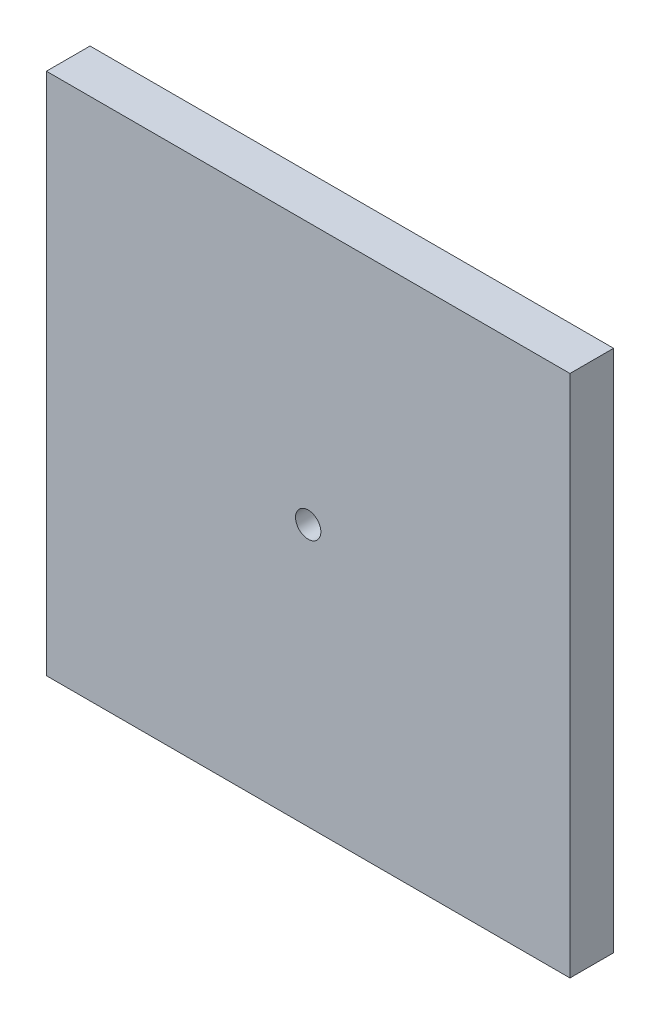
ISO-10303-21;
HEADER;
FILE_DESCRIPTION(('STEP AP214'),'2;1');
FILE_NAME('part.step','',(''),(''),'','','');
FILE_SCHEMA(('AUTOMOTIVE_DESIGN { 1 0 10303 214 1 1 1 1 }'));
ENDSEC;
DATA;
#1=APPLICATION_CONTEXT('core data for automotive mechanical design processes');
#2=APPLICATION_PROTOCOL_DEFINITION('international standard','automotive_design',2000,#1);
#3=PRODUCT_CONTEXT('',#1,'mechanical');
#4=PRODUCT('Part','Part','',(#3));
#5=PRODUCT_RELATED_PRODUCT_CATEGORY('part','',(#4));
#6=PRODUCT_DEFINITION_FORMATION('','',#4);
#7=PRODUCT_DEFINITION_CONTEXT('part definition',#1,'design');
#8=PRODUCT_DEFINITION('design','',#6,#7);
#9=PRODUCT_DEFINITION_SHAPE('','',#8);
#10=(LENGTH_UNIT() NAMED_UNIT(*) SI_UNIT(.MILLI.,.METRE.));
#11=(NAMED_UNIT(*) PLANE_ANGLE_UNIT() SI_UNIT($,.RADIAN.));
#12=(NAMED_UNIT(*) SI_UNIT($,.STERADIAN.) SOLID_ANGLE_UNIT());
#13=UNCERTAINTY_MEASURE_WITH_UNIT(LENGTH_MEASURE(1.E-05),#10,'distance_accuracy_value','');
#14=(GEOMETRIC_REPRESENTATION_CONTEXT(3) GLOBAL_UNCERTAINTY_ASSIGNED_CONTEXT((#13)) GLOBAL_UNIT_ASSIGNED_CONTEXT((#10,
#11,#12)) REPRESENTATION_CONTEXT('',''));
#15=CARTESIAN_POINT('',(0.,0.,0.));
#16=DIRECTION('',(0.,0.,1.));
#17=DIRECTION('',(1.,0.,0.));
#18=AXIS2_PLACEMENT_3D('',#15,#16,#17);
#19=CARTESIAN_POINT('',(0.,76.2,6.35));
#20=DIRECTION('',(0.,0.,-1.));
#21=DIRECTION('',(-1.,0.,0.));
#22=AXIS2_PLACEMENT_3D('',#19,#20,#21);
#23=PLANE('',#22);
#24=DIRECTION('',(0.,-1.,0.));
#25=VECTOR('',#24,1.);
#26=CARTESIAN_POINT('',(0.,0.,6.35));
#27=LINE('',#26,#25);
#28=CARTESIAN_POINT('',(0.,76.2,6.35));
#29=VERTEX_POINT('',#28);
#30=CARTESIAN_POINT('',(0.,0.,6.35));
#31=VERTEX_POINT('',#30);
#32=EDGE_CURVE('E85',#29,#31,#27,.T.);
#33=ORIENTED_EDGE('',*,*,#32,.T.);
#34=DIRECTION('',(1.,0.,0.));
#35=VECTOR('',#34,1.);
#36=CARTESIAN_POINT('',(0.,0.,6.35));
#37=LINE('',#36,#35);
#38=CARTESIAN_POINT('',(76.2,0.,6.35));
#39=VERTEX_POINT('',#38);
#40=EDGE_CURVE('E80',#31,#39,#37,.T.);
#41=ORIENTED_EDGE('',*,*,#40,.T.);
#42=DIRECTION('',(0.,1.,0.));
#43=VECTOR('',#42,1.);
#44=CARTESIAN_POINT('',(76.2,0.,6.35));
#45=LINE('',#44,#43);
#46=CARTESIAN_POINT('',(76.2,76.2,6.35));
#47=VERTEX_POINT('',#46);
#48=EDGE_CURVE('E83',#39,#47,#45,.T.);
#49=ORIENTED_EDGE('',*,*,#48,.T.);
#50=DIRECTION('',(-1.,0.,0.));
#51=VECTOR('',#50,1.);
#52=CARTESIAN_POINT('',(0.,76.2,6.35));
#53=LINE('',#52,#51);
#54=EDGE_CURVE('E50',#47,#29,#53,.T.);
#55=ORIENTED_EDGE('',*,*,#54,.T.);
#56=EDGE_LOOP('',(#33,#41,#49,#55));
#57=FACE_BOUND('',#56,.T.);
#58=CARTESIAN_POINT('',(38.1,38.1,6.35));
#59=DIRECTION('',(0.,0.,1.));
#60=DIRECTION('',(1.,0.,0.));
#61=AXIS2_PLACEMENT_3D('',#58,#59,#60);
#62=CIRCLE('',#61,1.8415);
#63=CARTESIAN_POINT('',(39.9415,38.1,6.35));
#64=VERTEX_POINT('',#63);
#65=EDGE_CURVE('E100',#64,#64,#62,.T.);
#66=ORIENTED_EDGE('',*,*,#65,.F.);
#67=EDGE_LOOP('',(#66));
#68=FACE_BOUND('',#67,.T.);
#69=ADVANCED_FACE('F33',(#57,#68),#23,.F.);
#70=CARTESIAN_POINT('',(0.,76.2,0.));
#71=DIRECTION('',(0.,0.,-1.));
#72=DIRECTION('',(-1.,0.,0.));
#73=AXIS2_PLACEMENT_3D('',#70,#71,#72);
#74=PLANE('',#73);
#75=DIRECTION('',(0.,-1.,0.));
#76=VECTOR('',#75,1.);
#77=CARTESIAN_POINT('',(0.,0.,0.));
#78=LINE('',#77,#76);
#79=CARTESIAN_POINT('',(0.,76.2,0.));
#80=VERTEX_POINT('',#79);
#81=CARTESIAN_POINT('',(0.,0.,0.));
#82=VERTEX_POINT('',#81);
#83=EDGE_CURVE('E97',#80,#82,#78,.T.);
#84=ORIENTED_EDGE('',*,*,#83,.F.);
#85=DIRECTION('',(-1.,0.,0.));
#86=VECTOR('',#85,1.);
#87=CARTESIAN_POINT('',(0.,76.2,0.));
#88=LINE('',#87,#86);
#89=CARTESIAN_POINT('',(76.2,76.2,0.));
#90=VERTEX_POINT('',#89);
#91=EDGE_CURVE('E73',#90,#80,#88,.T.);
#92=ORIENTED_EDGE('',*,*,#91,.F.);
#93=DIRECTION('',(0.,1.,0.));
#94=VECTOR('',#93,1.);
#95=CARTESIAN_POINT('',(76.2,0.,0.));
#96=LINE('',#95,#94);
#97=CARTESIAN_POINT('',(76.2,0.,0.));
#98=VERTEX_POINT('',#97);
#99=EDGE_CURVE('E67',#98,#90,#96,.T.);
#100=ORIENTED_EDGE('',*,*,#99,.F.);
#101=DIRECTION('',(1.,0.,0.));
#102=VECTOR('',#101,1.);
#103=CARTESIAN_POINT('',(0.,0.,0.));
#104=LINE('',#103,#102);
#105=EDGE_CURVE('E89',#82,#98,#104,.T.);
#106=ORIENTED_EDGE('',*,*,#105,.F.);
#107=EDGE_LOOP('',(#84,#92,#100,#106));
#108=FACE_BOUND('',#107,.T.);
#109=CARTESIAN_POINT('',(38.1,38.1,0.));
#110=DIRECTION('',(0.,0.,1.));
#111=DIRECTION('',(1.,0.,0.));
#112=AXIS2_PLACEMENT_3D('',#109,#110,#111);
#113=CIRCLE('',#112,1.8415);
#114=CARTESIAN_POINT('',(39.9415,38.1,0.));
#115=VERTEX_POINT('',#114);
#116=EDGE_CURVE('E112',#115,#115,#113,.T.);
#117=ORIENTED_EDGE('',*,*,#116,.T.);
#118=EDGE_LOOP('',(#117));
#119=FACE_BOUND('',#118,.T.);
#120=ADVANCED_FACE('F108',(#108,#119),#74,.T.);
#121=CARTESIAN_POINT('',(0.,0.,6.35));
#122=DIRECTION('',(1.,0.,0.));
#123=DIRECTION('',(0.,0.,-1.));
#124=AXIS2_PLACEMENT_3D('',#121,#122,#123);
#125=PLANE('',#124);
#126=ORIENTED_EDGE('',*,*,#83,.T.);
#127=DIRECTION('',(0.,0.,-1.));
#128=VECTOR('',#127,1.);
#129=CARTESIAN_POINT('',(0.,0.,6.35));
#130=LINE('',#129,#128);
#131=EDGE_CURVE('E11',#31,#82,#130,.T.);
#132=ORIENTED_EDGE('',*,*,#131,.F.);
#133=ORIENTED_EDGE('',*,*,#32,.F.);
#134=DIRECTION('',(0.,0.,-1.));
#135=VECTOR('',#134,1.);
#136=CARTESIAN_POINT('',(0.,76.2,6.35));
#137=LINE('',#136,#135);
#138=EDGE_CURVE('E93',#29,#80,#137,.T.);
#139=ORIENTED_EDGE('',*,*,#138,.T.);
#140=EDGE_LOOP('',(#126,#132,#133,#139));
#141=FACE_BOUND('',#140,.T.);
#142=ADVANCED_FACE('F35',(#141),#125,.F.);
#143=CARTESIAN_POINT('',(0.,0.,6.35));
#144=DIRECTION('',(0.,1.,0.));
#145=DIRECTION('',(0.,0.,1.));
#146=AXIS2_PLACEMENT_3D('',#143,#144,#145);
#147=PLANE('',#146);
#148=ORIENTED_EDGE('',*,*,#105,.T.);
#149=DIRECTION('',(0.,0.,-1.));
#150=VECTOR('',#149,1.);
#151=CARTESIAN_POINT('',(76.2,0.,6.35));
#152=LINE('',#151,#150);
#153=EDGE_CURVE('E42',#39,#98,#152,.T.);
#154=ORIENTED_EDGE('',*,*,#153,.F.);
#155=ORIENTED_EDGE('',*,*,#40,.F.);
#156=ORIENTED_EDGE('',*,*,#131,.T.);
#157=EDGE_LOOP('',(#148,#154,#155,#156));
#158=FACE_BOUND('',#157,.T.);
#159=ADVANCED_FACE('F88',(#158),#147,.F.);
#160=CARTESIAN_POINT('',(76.2,0.,6.35));
#161=DIRECTION('',(-1.,0.,0.));
#162=DIRECTION('',(0.,0.,1.));
#163=AXIS2_PLACEMENT_3D('',#160,#161,#162);
#164=PLANE('',#163);
#165=ORIENTED_EDGE('',*,*,#99,.T.);
#166=DIRECTION('',(0.,0.,-1.));
#167=VECTOR('',#166,1.);
#168=CARTESIAN_POINT('',(76.2,76.2,6.35));
#169=LINE('',#168,#167);
#170=EDGE_CURVE('E90',#47,#90,#169,.T.);
#171=ORIENTED_EDGE('',*,*,#170,.F.);
#172=ORIENTED_EDGE('',*,*,#48,.F.);
#173=ORIENTED_EDGE('',*,*,#153,.T.);
#174=EDGE_LOOP('',(#165,#171,#172,#173));
#175=FACE_BOUND('',#174,.T.);
#176=ADVANCED_FACE('F91',(#175),#164,.F.);
#177=CARTESIAN_POINT('',(0.,76.2,6.35));
#178=DIRECTION('',(0.,-1.,0.));
#179=DIRECTION('',(0.,0.,-1.));
#180=AXIS2_PLACEMENT_3D('',#177,#178,#179);
#181=PLANE('',#180);
#182=ORIENTED_EDGE('',*,*,#91,.T.);
#183=ORIENTED_EDGE('',*,*,#138,.F.);
#184=ORIENTED_EDGE('',*,*,#54,.F.);
#185=ORIENTED_EDGE('',*,*,#170,.T.);
#186=EDGE_LOOP('',(#182,#183,#184,#185));
#187=FACE_BOUND('',#186,.T.);
#188=ADVANCED_FACE('F105',(#187),#181,.F.);
#189=CARTESIAN_POINT('',(38.1,38.1,6.35));
#190=DIRECTION('',(0.,0.,-1.));
#191=DIRECTION('',(-1.,0.,0.));
#192=AXIS2_PLACEMENT_3D('',#189,#190,#191);
#193=CYLINDRICAL_SURFACE('',#192,1.8415);
#194=ORIENTED_EDGE('',*,*,#65,.T.);
#195=EDGE_LOOP('',(#194));
#196=FACE_BOUND('',#195,.T.);
#197=ORIENTED_EDGE('',*,*,#116,.F.);
#198=EDGE_LOOP('',(#197));
#199=FACE_BOUND('',#198,.T.);
#200=ADVANCED_FACE('F118',(#196,#199),#193,.F.);
#201=CLOSED_SHELL('',(#69,#120,#142,#159,#176,#188,#200));
#202=MANIFOLD_SOLID_BREP('B2',#201);
#203=ADVANCED_BREP_SHAPE_REPRESENTATION('',(#18,#202),#14);
#204=SHAPE_DEFINITION_REPRESENTATION(#9,#203);
ENDSEC;
END-ISO-10303-21;
